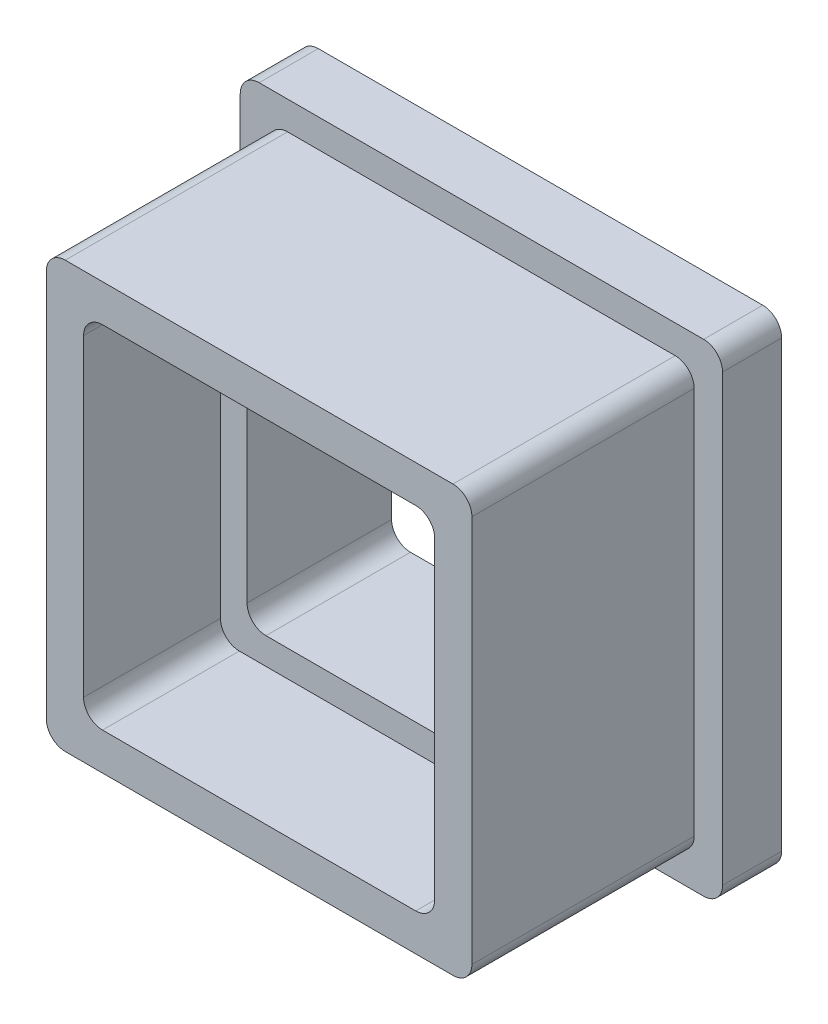
ISO-10303-21;
HEADER;
FILE_DESCRIPTION(('STEP AP214'),'2;1');
FILE_NAME('part.step','',(''),(''),'','','');
FILE_SCHEMA(('AUTOMOTIVE_DESIGN { 1 0 10303 214 1 1 1 1 }'));
ENDSEC;
DATA;
#1=APPLICATION_CONTEXT('core data for automotive mechanical design processes');
#2=APPLICATION_PROTOCOL_DEFINITION('international standard','automotive_design',2000,#1);
#3=PRODUCT_CONTEXT('',#1,'mechanical');
#4=PRODUCT('Part','Part','',(#3));
#5=PRODUCT_RELATED_PRODUCT_CATEGORY('part','',(#4));
#6=PRODUCT_DEFINITION_FORMATION('','',#4);
#7=PRODUCT_DEFINITION_CONTEXT('part definition',#1,'design');
#8=PRODUCT_DEFINITION('design','',#6,#7);
#9=PRODUCT_DEFINITION_SHAPE('','',#8);
#10=(LENGTH_UNIT() NAMED_UNIT(*) SI_UNIT(.MILLI.,.METRE.));
#11=(NAMED_UNIT(*) PLANE_ANGLE_UNIT() SI_UNIT($,.RADIAN.));
#12=(NAMED_UNIT(*) SI_UNIT($,.STERADIAN.) SOLID_ANGLE_UNIT());
#13=UNCERTAINTY_MEASURE_WITH_UNIT(LENGTH_MEASURE(1.E-05),#10,'distance_accuracy_value','');
#14=(GEOMETRIC_REPRESENTATION_CONTEXT(3) GLOBAL_UNCERTAINTY_ASSIGNED_CONTEXT((#13)) GLOBAL_UNIT_ASSIGNED_CONTEXT((#10,
#11,#12)) REPRESENTATION_CONTEXT('',''));
#15=CARTESIAN_POINT('',(0.,0.,0.));
#16=DIRECTION('',(0.,0.,1.));
#17=DIRECTION('',(1.,0.,0.));
#18=AXIS2_PLACEMENT_3D('',#15,#16,#17);
#19=CARTESIAN_POINT('',(5.715,5.715,-1.5875));
#20=DIRECTION('',(1.,0.,0.));
#21=DIRECTION('',(0.,1.,0.));
#22=AXIS2_PLACEMENT_3D('',#19,#20,#21);
#23=PLANE('',#22);
#24=DIRECTION('',(0.,0.,1.));
#25=VECTOR('',#24,1.);
#26=CARTESIAN_POINT('',(5.715,5.207,-1.5875));
#27=LINE('',#26,#25);
#28=CARTESIAN_POINT('',(5.715,5.207,-1.5875));
#29=VERTEX_POINT('',#28);
#30=CARTESIAN_POINT('',(5.715,5.207,4.3825));
#31=VERTEX_POINT('',#30);
#32=EDGE_CURVE('E273',#29,#31,#27,.T.);
#33=ORIENTED_EDGE('',*,*,#32,.T.);
#34=DIRECTION('',(0.,1.,0.));
#35=VECTOR('',#34,1.);
#36=CARTESIAN_POINT('',(5.71500000000001,-5.207,4.3825));
#37=LINE('',#36,#35);
#38=CARTESIAN_POINT('',(5.71500000000001,-5.207,4.3825));
#39=VERTEX_POINT('',#38);
#40=EDGE_CURVE('E333',#39,#31,#37,.T.);
#41=ORIENTED_EDGE('',*,*,#40,.F.);
#42=DIRECTION('',(0.,0.,1.));
#43=VECTOR('',#42,1.);
#44=CARTESIAN_POINT('',(5.71500000000001,-5.207,-1.5875));
#45=LINE('',#44,#43);
#46=CARTESIAN_POINT('',(5.71500000000001,-5.207,-1.5875));
#47=VERTEX_POINT('',#46);
#48=EDGE_CURVE('E276',#39,#47,#45,.F.);
#49=ORIENTED_EDGE('',*,*,#48,.T.);
#50=DIRECTION('',(0.,1.,0.));
#51=VECTOR('',#50,1.);
#52=CARTESIAN_POINT('',(5.715,5.715,-1.5875));
#53=LINE('',#52,#51);
#54=EDGE_CURVE('E318',#47,#29,#53,.T.);
#55=ORIENTED_EDGE('',*,*,#54,.T.);
#56=EDGE_LOOP('',(#33,#41,#49,#55));
#57=FACE_BOUND('',#56,.T.);
#58=ADVANCED_FACE('F35',(#57),#23,.T.);
#59=CARTESIAN_POINT('',(-5.715,-5.715,-1.5875));
#60=DIRECTION('',(0.,-1.,0.));
#61=DIRECTION('',(0.,0.,-1.));
#62=AXIS2_PLACEMENT_3D('',#59,#60,#61);
#63=PLANE('',#62);
#64=DIRECTION('',(0.,0.,1.));
#65=VECTOR('',#64,1.);
#66=CARTESIAN_POINT('',(5.20700000000001,-5.715,-1.5875));
#67=LINE('',#66,#65);
#68=CARTESIAN_POINT('',(5.207,-5.715,-1.5875));
#69=VERTEX_POINT('',#68);
#70=CARTESIAN_POINT('',(5.207,-5.715,4.3825));
#71=VERTEX_POINT('',#70);
#72=EDGE_CURVE('E263',#69,#71,#67,.T.);
#73=ORIENTED_EDGE('',*,*,#72,.T.);
#74=DIRECTION('',(1.,0.,0.));
#75=VECTOR('',#74,1.);
#76=CARTESIAN_POINT('',(-5.207,-5.715,4.3825));
#77=LINE('',#76,#75);
#78=CARTESIAN_POINT('',(-5.207,-5.715,4.3825));
#79=VERTEX_POINT('',#78);
#80=EDGE_CURVE('E885',#79,#71,#77,.T.);
#81=ORIENTED_EDGE('',*,*,#80,.F.);
#82=DIRECTION('',(0.,0.,1.));
#83=VECTOR('',#82,1.);
#84=CARTESIAN_POINT('',(-5.207,-5.715,-1.5875));
#85=LINE('',#84,#83);
#86=CARTESIAN_POINT('',(-5.207,-5.715,-1.5875));
#87=VERTEX_POINT('',#86);
#88=EDGE_CURVE('E271',#79,#87,#85,.F.);
#89=ORIENTED_EDGE('',*,*,#88,.T.);
#90=DIRECTION('',(1.,0.,0.));
#91=VECTOR('',#90,1.);
#92=CARTESIAN_POINT('',(-5.715,-5.715,-1.5875));
#93=LINE('',#92,#91);
#94=EDGE_CURVE('E405',#87,#69,#93,.T.);
#95=ORIENTED_EDGE('',*,*,#94,.T.);
#96=EDGE_LOOP('',(#73,#81,#89,#95));
#97=FACE_BOUND('',#96,.T.);
#98=ADVANCED_FACE('F541',(#97),#63,.T.);
#99=CARTESIAN_POINT('',(-5.71500000000001,5.715,-1.5875));
#100=DIRECTION('',(-1.,0.,0.));
#101=DIRECTION('',(0.,-1.,0.));
#102=AXIS2_PLACEMENT_3D('',#99,#100,#101);
#103=PLANE('',#102);
#104=DIRECTION('',(0.,0.,1.));
#105=VECTOR('',#104,1.);
#106=CARTESIAN_POINT('',(-5.715,-5.207,-1.5875));
#107=LINE('',#106,#105);
#108=CARTESIAN_POINT('',(-5.715,-5.207,-1.5875));
#109=VERTEX_POINT('',#108);
#110=CARTESIAN_POINT('',(-5.715,-5.207,4.3825));
#111=VERTEX_POINT('',#110);
#112=EDGE_CURVE('E257',#109,#111,#107,.T.);
#113=ORIENTED_EDGE('',*,*,#112,.T.);
#114=DIRECTION('',(0.,-1.,0.));
#115=VECTOR('',#114,1.);
#116=CARTESIAN_POINT('',(-5.71500000000001,5.207,4.3825));
#117=LINE('',#116,#115);
#118=CARTESIAN_POINT('',(-5.71500000000001,5.207,4.3825));
#119=VERTEX_POINT('',#118);
#120=EDGE_CURVE('E243',#119,#111,#117,.T.);
#121=ORIENTED_EDGE('',*,*,#120,.F.);
#122=DIRECTION('',(0.,0.,1.));
#123=VECTOR('',#122,1.);
#124=CARTESIAN_POINT('',(-5.71500000000001,5.207,-1.5875));
#125=LINE('',#124,#123);
#126=CARTESIAN_POINT('',(-5.71500000000001,5.207,-1.5875));
#127=VERTEX_POINT('',#126);
#128=EDGE_CURVE('E254',#119,#127,#125,.F.);
#129=ORIENTED_EDGE('',*,*,#128,.T.);
#130=DIRECTION('',(0.,-1.,0.));
#131=VECTOR('',#130,1.);
#132=CARTESIAN_POINT('',(-5.71500000000001,5.715,-1.5875));
#133=LINE('',#132,#131);
#134=EDGE_CURVE('E403',#127,#109,#133,.T.);
#135=ORIENTED_EDGE('',*,*,#134,.T.);
#136=EDGE_LOOP('',(#113,#121,#129,#135));
#137=FACE_BOUND('',#136,.T.);
#138=ADVANCED_FACE('F252',(#137),#103,.T.);
#139=CARTESIAN_POINT('',(-5.71500000000001,5.715,-1.5875));
#140=DIRECTION('',(0.,1.,0.));
#141=DIRECTION('',(0.,0.,1.));
#142=AXIS2_PLACEMENT_3D('',#139,#140,#141);
#143=PLANE('',#142);
#144=DIRECTION('',(0.,0.,1.));
#145=VECTOR('',#144,1.);
#146=CARTESIAN_POINT('',(-5.20700000000001,5.715,-1.5875));
#147=LINE('',#146,#145);
#148=CARTESIAN_POINT('',(-5.20700000000001,5.715,-1.5875));
#149=VERTEX_POINT('',#148);
#150=CARTESIAN_POINT('',(-5.20700000000001,5.715,4.3825));
#151=VERTEX_POINT('',#150);
#152=EDGE_CURVE('E283',#149,#151,#147,.T.);
#153=ORIENTED_EDGE('',*,*,#152,.T.);
#154=DIRECTION('',(-1.,0.,0.));
#155=VECTOR('',#154,1.);
#156=CARTESIAN_POINT('',(5.20699999999999,5.715,4.3825));
#157=LINE('',#156,#155);
#158=CARTESIAN_POINT('',(5.20699999999999,5.715,4.3825));
#159=VERTEX_POINT('',#158);
#160=EDGE_CURVE('E58',#159,#151,#157,.T.);
#161=ORIENTED_EDGE('',*,*,#160,.F.);
#162=DIRECTION('',(0.,0.,1.));
#163=VECTOR('',#162,1.);
#164=CARTESIAN_POINT('',(5.207,5.715,-1.5875));
#165=LINE('',#164,#163);
#166=CARTESIAN_POINT('',(5.20699999999999,5.715,-1.5875));
#167=VERTEX_POINT('',#166);
#168=EDGE_CURVE('E285',#159,#167,#165,.F.);
#169=ORIENTED_EDGE('',*,*,#168,.T.);
#170=DIRECTION('',(-1.,0.,0.));
#171=VECTOR('',#170,1.);
#172=CARTESIAN_POINT('',(-5.71500000000001,5.715,-1.5875));
#173=LINE('',#172,#171);
#174=EDGE_CURVE('E321',#167,#149,#173,.T.);
#175=ORIENTED_EDGE('',*,*,#174,.T.);
#176=EDGE_LOOP('',(#153,#161,#169,#175));
#177=FACE_BOUND('',#176,.T.);
#178=ADVANCED_FACE('F550',(#177),#143,.T.);
#179=CARTESIAN_POINT('',(4.715,4.715,0.7065));
#180=DIRECTION('',(1.,0.,0.));
#181=DIRECTION('',(0.,0.,-1.));
#182=AXIS2_PLACEMENT_3D('',#179,#180,#181);
#183=PLANE('',#182);
#184=DIRECTION('',(0.,-1.,0.));
#185=VECTOR('',#184,1.);
#186=CARTESIAN_POINT('',(4.715,4.715,4.3825));
#187=LINE('',#186,#185);
#188=CARTESIAN_POINT('',(4.715,4.207,4.3825));
#189=VERTEX_POINT('',#188);
#190=CARTESIAN_POINT('',(4.715,-4.207,4.3825));
#191=VERTEX_POINT('',#190);
#192=EDGE_CURVE('E50',#189,#191,#187,.T.);
#193=ORIENTED_EDGE('',*,*,#192,.F.);
#194=DIRECTION('',(0.,0.,1.));
#195=VECTOR('',#194,1.);
#196=CARTESIAN_POINT('',(4.715,4.207,0.7065));
#197=LINE('',#196,#195);
#198=CARTESIAN_POINT('',(4.715,4.207,0.7065));
#199=VERTEX_POINT('',#198);
#200=EDGE_CURVE('E446',#189,#199,#197,.F.);
#201=ORIENTED_EDGE('',*,*,#200,.T.);
#202=DIRECTION('',(0.,1.,0.));
#203=VECTOR('',#202,1.);
#204=CARTESIAN_POINT('',(4.715,4.715,0.7065));
#205=LINE('',#204,#203);
#206=CARTESIAN_POINT('',(4.715,-4.207,0.7065));
#207=VERTEX_POINT('',#206);
#208=EDGE_CURVE('E367',#207,#199,#205,.T.);
#209=ORIENTED_EDGE('',*,*,#208,.F.);
#210=DIRECTION('',(0.,0.,1.));
#211=VECTOR('',#210,1.);
#212=CARTESIAN_POINT('',(4.715,-4.207,4.7625));
#213=LINE('',#212,#211);
#214=EDGE_CURVE('E443',#207,#191,#213,.T.);
#215=ORIENTED_EDGE('',*,*,#214,.T.);
#216=EDGE_LOOP('',(#193,#201,#209,#215));
#217=FACE_BOUND('',#216,.T.);
#218=ADVANCED_FACE('F591',(#217),#183,.F.);
#219=CARTESIAN_POINT('',(-4.715,-4.715,0.7065));
#220=DIRECTION('',(0.,-1.,0.));
#221=DIRECTION('',(0.,0.,-1.));
#222=AXIS2_PLACEMENT_3D('',#219,#220,#221);
#223=PLANE('',#222);
#224=DIRECTION('',(-1.,0.,0.));
#225=VECTOR('',#224,1.);
#226=CARTESIAN_POINT('',(-4.715,-4.715,4.3825));
#227=LINE('',#226,#225);
#228=CARTESIAN_POINT('',(4.207,-4.715,4.3825));
#229=VERTEX_POINT('',#228);
#230=CARTESIAN_POINT('',(-4.207,-4.715,4.3825));
#231=VERTEX_POINT('',#230);
#232=EDGE_CURVE('E342',#229,#231,#227,.T.);
#233=ORIENTED_EDGE('',*,*,#232,.F.);
#234=DIRECTION('',(0.,0.,1.));
#235=VECTOR('',#234,1.);
#236=CARTESIAN_POINT('',(4.207,-4.715,0.7065));
#237=LINE('',#236,#235);
#238=CARTESIAN_POINT('',(4.207,-4.715,0.7065));
#239=VERTEX_POINT('',#238);
#240=EDGE_CURVE('E420',#229,#239,#237,.F.);
#241=ORIENTED_EDGE('',*,*,#240,.T.);
#242=DIRECTION('',(1.,0.,0.));
#243=VECTOR('',#242,1.);
#244=CARTESIAN_POINT('',(-4.715,-4.715,0.7065));
#245=LINE('',#244,#243);
#246=CARTESIAN_POINT('',(-4.207,-4.715,0.7065));
#247=VERTEX_POINT('',#246);
#248=EDGE_CURVE('E376',#247,#239,#245,.T.);
#249=ORIENTED_EDGE('',*,*,#248,.F.);
#250=DIRECTION('',(0.,0.,1.));
#251=VECTOR('',#250,1.);
#252=CARTESIAN_POINT('',(-4.207,-4.715,4.7625));
#253=LINE('',#252,#251);
#254=EDGE_CURVE('E422',#247,#231,#253,.T.);
#255=ORIENTED_EDGE('',*,*,#254,.T.);
#256=EDGE_LOOP('',(#233,#241,#249,#255));
#257=FACE_BOUND('',#256,.T.);
#258=ADVANCED_FACE('F615',(#257),#223,.F.);
#259=CARTESIAN_POINT('',(-4.715,4.715,0.7065));
#260=DIRECTION('',(-1.,0.,0.));
#261=DIRECTION('',(0.,0.,1.));
#262=AXIS2_PLACEMENT_3D('',#259,#260,#261);
#263=PLANE('',#262);
#264=DIRECTION('',(0.,1.,0.));
#265=VECTOR('',#264,1.);
#266=CARTESIAN_POINT('',(-4.715,4.715,4.3825));
#267=LINE('',#266,#265);
#268=CARTESIAN_POINT('',(-4.715,-4.207,4.3825));
#269=VERTEX_POINT('',#268);
#270=CARTESIAN_POINT('',(-4.715,4.207,4.3825));
#271=VERTEX_POINT('',#270);
#272=EDGE_CURVE('E351',#269,#271,#267,.T.);
#273=ORIENTED_EDGE('',*,*,#272,.F.);
#274=DIRECTION('',(0.,0.,1.));
#275=VECTOR('',#274,1.);
#276=CARTESIAN_POINT('',(-4.715,-4.207,0.7065));
#277=LINE('',#276,#275);
#278=CARTESIAN_POINT('',(-4.715,-4.207,0.7065));
#279=VERTEX_POINT('',#278);
#280=EDGE_CURVE('E428',#269,#279,#277,.F.);
#281=ORIENTED_EDGE('',*,*,#280,.T.);
#282=DIRECTION('',(0.,-1.,0.));
#283=VECTOR('',#282,1.);
#284=CARTESIAN_POINT('',(-4.715,4.715,0.7065));
#285=LINE('',#284,#283);
#286=CARTESIAN_POINT('',(-4.715,4.207,0.7065));
#287=VERTEX_POINT('',#286);
#288=EDGE_CURVE('E373',#287,#279,#285,.T.);
#289=ORIENTED_EDGE('',*,*,#288,.F.);
#290=DIRECTION('',(0.,0.,1.));
#291=VECTOR('',#290,1.);
#292=CARTESIAN_POINT('',(-4.715,4.207,4.7625));
#293=LINE('',#292,#291);
#294=EDGE_CURVE('E425',#287,#271,#293,.T.);
#295=ORIENTED_EDGE('',*,*,#294,.T.);
#296=EDGE_LOOP('',(#273,#281,#289,#295));
#297=FACE_BOUND('',#296,.T.);
#298=ADVANCED_FACE('F608',(#297),#263,.F.);
#299=CARTESIAN_POINT('',(-4.715,4.715,0.7065));
#300=DIRECTION('',(0.,1.,0.));
#301=DIRECTION('',(0.,0.,1.));
#302=AXIS2_PLACEMENT_3D('',#299,#300,#301);
#303=PLANE('',#302);
#304=DIRECTION('',(1.,0.,0.));
#305=VECTOR('',#304,1.);
#306=CARTESIAN_POINT('',(-4.715,4.715,4.3825));
#307=LINE('',#306,#305);
#308=CARTESIAN_POINT('',(-4.207,4.715,4.3825));
#309=VERTEX_POINT('',#308);
#310=CARTESIAN_POINT('',(4.207,4.715,4.3825));
#311=VERTEX_POINT('',#310);
#312=EDGE_CURVE('E349',#309,#311,#307,.T.);
#313=ORIENTED_EDGE('',*,*,#312,.F.);
#314=DIRECTION('',(0.,0.,1.));
#315=VECTOR('',#314,1.);
#316=CARTESIAN_POINT('',(-4.207,4.715,0.7065));
#317=LINE('',#316,#315);
#318=CARTESIAN_POINT('',(-4.207,4.715,0.7065));
#319=VERTEX_POINT('',#318);
#320=EDGE_CURVE('E441',#309,#319,#317,.F.);
#321=ORIENTED_EDGE('',*,*,#320,.T.);
#322=DIRECTION('',(-1.,0.,0.));
#323=VECTOR('',#322,1.);
#324=CARTESIAN_POINT('',(-4.715,4.715,0.7065));
#325=LINE('',#324,#323);
#326=CARTESIAN_POINT('',(4.207,4.715,0.7065));
#327=VERTEX_POINT('',#326);
#328=EDGE_CURVE('E370',#327,#319,#325,.T.);
#329=ORIENTED_EDGE('',*,*,#328,.F.);
#330=DIRECTION('',(0.,0.,1.));
#331=VECTOR('',#330,1.);
#332=CARTESIAN_POINT('',(4.207,4.715,4.7625));
#333=LINE('',#332,#331);
#334=EDGE_CURVE('E438',#327,#311,#333,.T.);
#335=ORIENTED_EDGE('',*,*,#334,.T.);
#336=EDGE_LOOP('',(#313,#321,#329,#335));
#337=FACE_BOUND('',#336,.T.);
#338=ADVANCED_FACE('F556',(#337),#303,.F.);
#339=CARTESIAN_POINT('',(-4.207,-4.207,0.7065));
#340=DIRECTION('',(0.,0.,-1.));
#341=DIRECTION('',(-1.,0.,0.));
#342=AXIS2_PLACEMENT_3D('',#339,#340,#341);
#343=CYLINDRICAL_SURFACE('',#342,0.508);
#344=CARTESIAN_POINT('',(-4.207,-4.207,4.3825));
#345=DIRECTION('',(0.,0.,1.));
#346=DIRECTION('',(1.,0.,0.));
#347=AXIS2_PLACEMENT_3D('',#344,#345,#346);
#348=CIRCLE('',#347,0.508);
#349=EDGE_CURVE('E347',#231,#269,#348,.F.);
#350=ORIENTED_EDGE('',*,*,#349,.F.);
#351=ORIENTED_EDGE('',*,*,#254,.F.);
#352=CARTESIAN_POINT('',(-4.207,-4.207,0.7065));
#353=DIRECTION('',(0.,0.,1.));
#354=DIRECTION('',(1.,0.,0.));
#355=AXIS2_PLACEMENT_3D('',#352,#353,#354);
#356=CIRCLE('',#355,0.508);
#357=EDGE_CURVE('E436',#279,#247,#356,.T.);
#358=ORIENTED_EDGE('',*,*,#357,.F.);
#359=ORIENTED_EDGE('',*,*,#280,.F.);
#360=EDGE_LOOP('',(#350,#351,#358,#359));
#361=FACE_BOUND('',#360,.T.);
#362=ADVANCED_FACE('F552',(#361),#343,.F.);
#363=CARTESIAN_POINT('',(-4.207,4.207,0.7065));
#364=DIRECTION('',(0.,0.,-1.));
#365=DIRECTION('',(-1.,0.,0.));
#366=AXIS2_PLACEMENT_3D('',#363,#364,#365);
#367=CYLINDRICAL_SURFACE('',#366,0.508);
#368=CARTESIAN_POINT('',(-4.207,4.207,4.3825));
#369=DIRECTION('',(0.,0.,1.));
#370=DIRECTION('',(1.,0.,0.));
#371=AXIS2_PLACEMENT_3D('',#368,#369,#370);
#372=CIRCLE('',#371,0.508);
#373=EDGE_CURVE('E353',#271,#309,#372,.F.);
#374=ORIENTED_EDGE('',*,*,#373,.F.);
#375=ORIENTED_EDGE('',*,*,#294,.F.);
#376=CARTESIAN_POINT('',(-4.207,4.207,0.7065));
#377=DIRECTION('',(0.,0.,1.));
#378=DIRECTION('',(1.,0.,0.));
#379=AXIS2_PLACEMENT_3D('',#376,#377,#378);
#380=CIRCLE('',#379,0.508);
#381=EDGE_CURVE('E434',#319,#287,#380,.T.);
#382=ORIENTED_EDGE('',*,*,#381,.F.);
#383=ORIENTED_EDGE('',*,*,#320,.F.);
#384=EDGE_LOOP('',(#374,#375,#382,#383));
#385=FACE_BOUND('',#384,.T.);
#386=ADVANCED_FACE('F555',(#385),#367,.F.);
#387=CARTESIAN_POINT('',(4.207,4.207,0.7065));
#388=DIRECTION('',(0.,0.,-1.));
#389=DIRECTION('',(-1.,0.,0.));
#390=AXIS2_PLACEMENT_3D('',#387,#388,#389);
#391=CYLINDRICAL_SURFACE('',#390,0.508);
#392=CARTESIAN_POINT('',(4.207,4.207,4.3825));
#393=DIRECTION('',(0.,0.,1.));
#394=DIRECTION('',(1.,0.,0.));
#395=AXIS2_PLACEMENT_3D('',#392,#393,#394);
#396=CIRCLE('',#395,0.508);
#397=EDGE_CURVE('E345',#311,#189,#396,.F.);
#398=ORIENTED_EDGE('',*,*,#397,.F.);
#399=ORIENTED_EDGE('',*,*,#334,.F.);
#400=CARTESIAN_POINT('',(4.207,4.207,0.7065));
#401=DIRECTION('',(0.,0.,1.));
#402=DIRECTION('',(1.,0.,0.));
#403=AXIS2_PLACEMENT_3D('',#400,#401,#402);
#404=CIRCLE('',#403,0.508);
#405=EDGE_CURVE('E432',#199,#327,#404,.T.);
#406=ORIENTED_EDGE('',*,*,#405,.F.);
#407=ORIENTED_EDGE('',*,*,#200,.F.);
#408=EDGE_LOOP('',(#398,#399,#406,#407));
#409=FACE_BOUND('',#408,.T.);
#410=ADVANCED_FACE('F560',(#409),#391,.F.);
#411=CARTESIAN_POINT('',(4.207,-4.207,0.7065));
#412=DIRECTION('',(0.,0.,-1.));
#413=DIRECTION('',(-1.,0.,0.));
#414=AXIS2_PLACEMENT_3D('',#411,#412,#413);
#415=CYLINDRICAL_SURFACE('',#414,0.508);
#416=CARTESIAN_POINT('',(4.207,-4.207,4.3825));
#417=DIRECTION('',(0.,0.,1.));
#418=DIRECTION('',(1.,0.,0.));
#419=AXIS2_PLACEMENT_3D('',#416,#417,#418);
#420=CIRCLE('',#419,0.508);
#421=EDGE_CURVE('E335',#191,#229,#420,.F.);
#422=ORIENTED_EDGE('',*,*,#421,.F.);
#423=ORIENTED_EDGE('',*,*,#214,.F.);
#424=CARTESIAN_POINT('',(4.207,-4.207,0.7065));
#425=DIRECTION('',(0.,0.,1.));
#426=DIRECTION('',(1.,0.,0.));
#427=AXIS2_PLACEMENT_3D('',#424,#425,#426);
#428=CIRCLE('',#427,0.508);
#429=EDGE_CURVE('E430',#239,#207,#428,.T.);
#430=ORIENTED_EDGE('',*,*,#429,.F.);
#431=ORIENTED_EDGE('',*,*,#240,.F.);
#432=EDGE_LOOP('',(#422,#423,#430,#431));
#433=FACE_BOUND('',#432,.T.);
#434=ADVANCED_FACE('F564',(#433),#415,.F.);
#435=CARTESIAN_POINT('',(-5.207,-5.207,-1.5875));
#436=DIRECTION('',(0.,0.,1.));
#437=DIRECTION('',(1.,0.,0.));
#438=AXIS2_PLACEMENT_3D('',#435,#436,#437);
#439=CYLINDRICAL_SURFACE('',#438,0.508);
#440=ORIENTED_EDGE('',*,*,#88,.F.);
#441=CARTESIAN_POINT('',(-5.207,-5.207,4.3825));
#442=DIRECTION('',(0.,0.,1.));
#443=DIRECTION('',(1.,0.,0.));
#444=AXIS2_PLACEMENT_3D('',#441,#442,#443);
#445=CIRCLE('',#444,0.508);
#446=EDGE_CURVE('E258',#111,#79,#445,.T.);
#447=ORIENTED_EDGE('',*,*,#446,.F.);
#448=ORIENTED_EDGE('',*,*,#112,.F.);
#449=CARTESIAN_POINT('',(-5.207,-5.207,-1.5875));
#450=DIRECTION('',(0.,0.,-1.));
#451=DIRECTION('',(-1.,0.,0.));
#452=AXIS2_PLACEMENT_3D('',#449,#450,#451);
#453=CIRCLE('',#452,0.508);
#454=EDGE_CURVE('E308',#87,#109,#453,.T.);
#455=ORIENTED_EDGE('',*,*,#454,.F.);
#456=EDGE_LOOP('',(#440,#447,#448,#455));
#457=FACE_BOUND('',#456,.T.);
#458=ADVANCED_FACE('F578',(#457),#439,.T.);
#459=CARTESIAN_POINT('',(5.20700000000001,-5.207,-1.5875));
#460=DIRECTION('',(0.,0.,1.));
#461=DIRECTION('',(1.,0.,0.));
#462=AXIS2_PLACEMENT_3D('',#459,#460,#461);
#463=CYLINDRICAL_SURFACE('',#462,0.508);
#464=ORIENTED_EDGE('',*,*,#48,.F.);
#465=CARTESIAN_POINT('',(5.20700000000001,-5.207,4.3825));
#466=DIRECTION('',(0.,0.,1.));
#467=DIRECTION('',(1.,0.,0.));
#468=AXIS2_PLACEMENT_3D('',#465,#466,#467);
#469=CIRCLE('',#468,0.508);
#470=EDGE_CURVE('E337',#71,#39,#469,.T.);
#471=ORIENTED_EDGE('',*,*,#470,.F.);
#472=ORIENTED_EDGE('',*,*,#72,.F.);
#473=CARTESIAN_POINT('',(5.20700000000001,-5.207,-1.5875));
#474=DIRECTION('',(0.,0.,-1.));
#475=DIRECTION('',(-1.,0.,0.));
#476=AXIS2_PLACEMENT_3D('',#473,#474,#475);
#477=CIRCLE('',#476,0.508);
#478=EDGE_CURVE('E310',#47,#69,#477,.T.);
#479=ORIENTED_EDGE('',*,*,#478,.F.);
#480=EDGE_LOOP('',(#464,#471,#472,#479));
#481=FACE_BOUND('',#480,.T.);
#482=ADVANCED_FACE('F583',(#481),#463,.T.);
#483=CARTESIAN_POINT('',(5.207,5.207,-1.5875));
#484=DIRECTION('',(0.,0.,1.));
#485=DIRECTION('',(1.,0.,0.));
#486=AXIS2_PLACEMENT_3D('',#483,#484,#485);
#487=CYLINDRICAL_SURFACE('',#486,0.508);
#488=ORIENTED_EDGE('',*,*,#168,.F.);
#489=CARTESIAN_POINT('',(5.207,5.207,4.3825));
#490=DIRECTION('',(0.,0.,1.));
#491=DIRECTION('',(1.,0.,0.));
#492=AXIS2_PLACEMENT_3D('',#489,#490,#491);
#493=CIRCLE('',#492,0.508);
#494=EDGE_CURVE('E332',#31,#159,#493,.T.);
#495=ORIENTED_EDGE('',*,*,#494,.F.);
#496=ORIENTED_EDGE('',*,*,#32,.F.);
#497=CARTESIAN_POINT('',(5.207,5.207,-1.5875));
#498=DIRECTION('',(0.,0.,-1.));
#499=DIRECTION('',(-1.,0.,0.));
#500=AXIS2_PLACEMENT_3D('',#497,#498,#499);
#501=CIRCLE('',#500,0.508);
#502=EDGE_CURVE('E43',#167,#29,#501,.T.);
#503=ORIENTED_EDGE('',*,*,#502,.F.);
#504=EDGE_LOOP('',(#488,#495,#496,#503));
#505=FACE_BOUND('',#504,.T.);
#506=ADVANCED_FACE('F331',(#505),#487,.T.);
#507=CARTESIAN_POINT('',(-5.20700000000001,5.207,-1.5875));
#508=DIRECTION('',(0.,0.,1.));
#509=DIRECTION('',(1.,0.,0.));
#510=AXIS2_PLACEMENT_3D('',#507,#508,#509);
#511=CYLINDRICAL_SURFACE('',#510,0.508);
#512=ORIENTED_EDGE('',*,*,#128,.F.);
#513=CARTESIAN_POINT('',(-5.20700000000001,5.207,4.3825));
#514=DIRECTION('',(0.,0.,1.));
#515=DIRECTION('',(1.,0.,0.));
#516=AXIS2_PLACEMENT_3D('',#513,#514,#515);
#517=CIRCLE('',#516,0.508);
#518=EDGE_CURVE('E240',#151,#119,#517,.T.);
#519=ORIENTED_EDGE('',*,*,#518,.F.);
#520=ORIENTED_EDGE('',*,*,#152,.F.);
#521=CARTESIAN_POINT('',(-5.20700000000001,5.207,-1.5875));
#522=DIRECTION('',(0.,0.,-1.));
#523=DIRECTION('',(-1.,0.,0.));
#524=AXIS2_PLACEMENT_3D('',#521,#522,#523);
#525=CIRCLE('',#524,0.508);
#526=EDGE_CURVE('E11',#127,#149,#525,.T.);
#527=ORIENTED_EDGE('',*,*,#526,.F.);
#528=EDGE_LOOP('',(#512,#519,#520,#527));
#529=FACE_BOUND('',#528,.T.);
#530=ADVANCED_FACE('F37',(#529),#511,.T.);
#531=CARTESIAN_POINT('',(-6.477,6.477,-3.175));
#532=DIRECTION('',(0.,-1.,0.));
#533=DIRECTION('',(1.,0.,0.));
#534=AXIS2_PLACEMENT_3D('',#531,#532,#533);
#535=PLANE('',#534);
#536=DIRECTION('',(1.,0.,0.));
#537=VECTOR('',#536,1.);
#538=CARTESIAN_POINT('',(-6.477,6.477,-1.5875));
#539=LINE('',#538,#537);
#540=CARTESIAN_POINT('',(-5.969,6.477,-1.5875));
#541=VERTEX_POINT('',#540);
#542=CARTESIAN_POINT('',(5.969,6.477,-1.5875));
#543=VERTEX_POINT('',#542);
#544=EDGE_CURVE('E379',#541,#543,#539,.T.);
#545=ORIENTED_EDGE('',*,*,#544,.T.);
#546=DIRECTION('',(0.,0.,1.));
#547=VECTOR('',#546,1.);
#548=CARTESIAN_POINT('',(5.969,6.477,-3.175));
#549=LINE('',#548,#547);
#550=CARTESIAN_POINT('',(5.969,6.477,-3.175));
#551=VERTEX_POINT('',#550);
#552=EDGE_CURVE('E290',#543,#551,#549,.F.);
#553=ORIENTED_EDGE('',*,*,#552,.T.);
#554=DIRECTION('',(1.,0.,0.));
#555=VECTOR('',#554,1.);
#556=CARTESIAN_POINT('',(-6.477,6.477,-3.175));
#557=LINE('',#556,#555);
#558=CARTESIAN_POINT('',(-5.969,6.477,-3.175));
#559=VERTEX_POINT('',#558);
#560=EDGE_CURVE('E380',#559,#551,#557,.T.);
#561=ORIENTED_EDGE('',*,*,#560,.F.);
#562=DIRECTION('',(0.,0.,1.));
#563=VECTOR('',#562,1.);
#564=CARTESIAN_POINT('',(-5.969,6.477,-3.175));
#565=LINE('',#564,#563);
#566=EDGE_CURVE('E287',#559,#541,#565,.T.);
#567=ORIENTED_EDGE('',*,*,#566,.T.);
#568=EDGE_LOOP('',(#545,#553,#561,#567));
#569=FACE_BOUND('',#568,.T.);
#570=ADVANCED_FACE('F514',(#569),#535,.F.);
#571=CARTESIAN_POINT('',(6.477,6.477,-3.175));
#572=DIRECTION('',(-1.,0.,0.));
#573=DIRECTION('',(0.,-1.,0.));
#574=AXIS2_PLACEMENT_3D('',#571,#572,#573);
#575=PLANE('',#574);
#576=DIRECTION('',(0.,-1.,0.));
#577=VECTOR('',#576,1.);
#578=CARTESIAN_POINT('',(6.477,6.477,-1.5875));
#579=LINE('',#578,#577);
#580=CARTESIAN_POINT('',(6.477,5.969,-1.5875));
#581=VERTEX_POINT('',#580);
#582=CARTESIAN_POINT('',(6.477,-5.96899999999999,-1.5875));
#583=VERTEX_POINT('',#582);
#584=EDGE_CURVE('E394',#581,#583,#579,.T.);
#585=ORIENTED_EDGE('',*,*,#584,.T.);
#586=DIRECTION('',(0.,0.,1.));
#587=VECTOR('',#586,1.);
#588=CARTESIAN_POINT('',(6.477,-5.969,-3.175));
#589=LINE('',#588,#587);
#590=CARTESIAN_POINT('',(6.477,-5.96899999999999,-3.175));
#591=VERTEX_POINT('',#590);
#592=EDGE_CURVE('E281',#583,#591,#589,.F.);
#593=ORIENTED_EDGE('',*,*,#592,.T.);
#594=DIRECTION('',(0.,-1.,0.));
#595=VECTOR('',#594,1.);
#596=CARTESIAN_POINT('',(6.477,6.477,-3.175));
#597=LINE('',#596,#595);
#598=CARTESIAN_POINT('',(6.477,5.969,-3.175));
#599=VERTEX_POINT('',#598);
#600=EDGE_CURVE('E383',#599,#591,#597,.T.);
#601=ORIENTED_EDGE('',*,*,#600,.F.);
#602=DIRECTION('',(0.,0.,1.));
#603=VECTOR('',#602,1.);
#604=CARTESIAN_POINT('',(6.477,5.969,-3.175));
#605=LINE('',#604,#603);
#606=EDGE_CURVE('E278',#599,#581,#605,.T.);
#607=ORIENTED_EDGE('',*,*,#606,.T.);
#608=EDGE_LOOP('',(#585,#593,#601,#607));
#609=FACE_BOUND('',#608,.T.);
#610=ADVANCED_FACE('F506',(#609),#575,.F.);
#611=CARTESIAN_POINT('',(6.477,-6.477,-3.175));
#612=DIRECTION('',(0.,1.,0.));
#613=DIRECTION('',(-1.,0.,0.));
#614=AXIS2_PLACEMENT_3D('',#611,#612,#613);
#615=PLANE('',#614);
#616=DIRECTION('',(-1.,0.,0.));
#617=VECTOR('',#616,1.);
#618=CARTESIAN_POINT('',(6.477,-6.477,-1.5875));
#619=LINE('',#618,#617);
#620=CARTESIAN_POINT('',(5.969,-6.477,-1.5875));
#621=VERTEX_POINT('',#620);
#622=CARTESIAN_POINT('',(-5.96899999999999,-6.477,-1.5875));
#623=VERTEX_POINT('',#622);
#624=EDGE_CURVE('E397',#621,#623,#619,.T.);
#625=ORIENTED_EDGE('',*,*,#624,.T.);
#626=DIRECTION('',(0.,0.,1.));
#627=VECTOR('',#626,1.);
#628=CARTESIAN_POINT('',(-5.969,-6.477,-3.175));
#629=LINE('',#628,#627);
#630=CARTESIAN_POINT('',(-5.96899999999999,-6.477,-3.175));
#631=VERTEX_POINT('',#630);
#632=EDGE_CURVE('E484',#623,#631,#629,.F.);
#633=ORIENTED_EDGE('',*,*,#632,.T.);
#634=DIRECTION('',(-1.,0.,0.));
#635=VECTOR('',#634,1.);
#636=CARTESIAN_POINT('',(6.477,-6.477,-3.175));
#637=LINE('',#636,#635);
#638=CARTESIAN_POINT('',(5.969,-6.477,-3.175));
#639=VERTEX_POINT('',#638);
#640=EDGE_CURVE('E387',#639,#631,#637,.T.);
#641=ORIENTED_EDGE('',*,*,#640,.F.);
#642=DIRECTION('',(0.,0.,1.));
#643=VECTOR('',#642,1.);
#644=CARTESIAN_POINT('',(5.969,-6.477,-3.175));
#645=LINE('',#644,#643);
#646=EDGE_CURVE('E481',#639,#621,#645,.T.);
#647=ORIENTED_EDGE('',*,*,#646,.T.);
#648=EDGE_LOOP('',(#625,#633,#641,#647));
#649=FACE_BOUND('',#648,.T.);
#650=ADVANCED_FACE('F499',(#649),#615,.F.);
#651=CARTESIAN_POINT('',(-6.477,-6.477,-3.175));
#652=DIRECTION('',(1.,0.,0.));
#653=DIRECTION('',(0.,0.,-1.));
#654=AXIS2_PLACEMENT_3D('',#651,#652,#653);
#655=PLANE('',#654);
#656=DIRECTION('',(0.,1.,0.));
#657=VECTOR('',#656,1.);
#658=CARTESIAN_POINT('',(-6.477,-6.477,-3.175));
#659=LINE('',#658,#657);
#660=CARTESIAN_POINT('',(-6.477,-5.969,-3.175));
#661=VERTEX_POINT('',#660);
#662=CARTESIAN_POINT('',(-6.477,5.969,-3.175));
#663=VERTEX_POINT('',#662);
#664=EDGE_CURVE('E328',#661,#663,#659,.T.);
#665=ORIENTED_EDGE('',*,*,#664,.F.);
#666=DIRECTION('',(0.,0.,1.));
#667=VECTOR('',#666,1.);
#668=CARTESIAN_POINT('',(-6.477,-5.969,-3.175));
#669=LINE('',#668,#667);
#670=CARTESIAN_POINT('',(-6.477,-5.969,-1.5875));
#671=VERTEX_POINT('',#670);
#672=EDGE_CURVE('E470',#661,#671,#669,.T.);
#673=ORIENTED_EDGE('',*,*,#672,.T.);
#674=DIRECTION('',(0.,1.,0.));
#675=VECTOR('',#674,1.);
#676=CARTESIAN_POINT('',(-6.477,-6.477,-1.5875));
#677=LINE('',#676,#675);
#678=CARTESIAN_POINT('',(-6.477,5.969,-1.5875));
#679=VERTEX_POINT('',#678);
#680=EDGE_CURVE('E384',#671,#679,#677,.T.);
#681=ORIENTED_EDGE('',*,*,#680,.T.);
#682=DIRECTION('',(0.,0.,1.));
#683=VECTOR('',#682,1.);
#684=CARTESIAN_POINT('',(-6.477,5.969,-3.175));
#685=LINE('',#684,#683);
#686=EDGE_CURVE('E468',#679,#663,#685,.F.);
#687=ORIENTED_EDGE('',*,*,#686,.T.);
#688=EDGE_LOOP('',(#665,#673,#681,#687));
#689=FACE_BOUND('',#688,.T.);
#690=ADVANCED_FACE('F523',(#689),#655,.F.);
#691=CARTESIAN_POINT('',(0.,0.,-3.175));
#692=DIRECTION('',(0.,0.,-1.));
#693=DIRECTION('',(-1.,0.,0.));
#694=AXIS2_PLACEMENT_3D('',#691,#692,#693);
#695=PLANE('',#694);
#696=DIRECTION('',(0.,-1.,0.));
#697=VECTOR('',#696,1.);
#698=CARTESIAN_POINT('',(4.,4.,-3.175));
#699=LINE('',#698,#697);
#700=CARTESIAN_POINT('',(4.,3.492,-3.175));
#701=VERTEX_POINT('',#700);
#702=CARTESIAN_POINT('',(4.,-3.492,-3.175));
#703=VERTEX_POINT('',#702);
#704=EDGE_CURVE('E355',#701,#703,#699,.T.);
#705=ORIENTED_EDGE('',*,*,#704,.F.);
#706=CARTESIAN_POINT('',(3.492,3.492,-3.175));
#707=DIRECTION('',(0.,0.,-1.));
#708=DIRECTION('',(-1.,0.,0.));
#709=AXIS2_PLACEMENT_3D('',#706,#707,#708);
#710=CIRCLE('',#709,0.508);
#711=CARTESIAN_POINT('',(3.492,4.,-3.175));
#712=VERTEX_POINT('',#711);
#713=EDGE_CURVE('E292',#701,#712,#710,.F.);
#714=ORIENTED_EDGE('',*,*,#713,.T.);
#715=DIRECTION('',(1.,0.,0.));
#716=VECTOR('',#715,1.);
#717=CARTESIAN_POINT('',(-4.,4.,-3.175));
#718=LINE('',#717,#716);
#719=CARTESIAN_POINT('',(-3.492,4.,-3.175));
#720=VERTEX_POINT('',#719);
#721=EDGE_CURVE('E364',#720,#712,#718,.T.);
#722=ORIENTED_EDGE('',*,*,#721,.F.);
#723=CARTESIAN_POINT('',(-3.492,3.492,-3.175));
#724=DIRECTION('',(0.,0.,-1.));
#725=DIRECTION('',(-1.,0.,0.));
#726=AXIS2_PLACEMENT_3D('',#723,#724,#725);
#727=CIRCLE('',#726,0.508);
#728=CARTESIAN_POINT('',(-4.,3.492,-3.175));
#729=VERTEX_POINT('',#728);
#730=EDGE_CURVE('E296',#720,#729,#727,.F.);
#731=ORIENTED_EDGE('',*,*,#730,.T.);
#732=DIRECTION('',(0.,1.,0.));
#733=VECTOR('',#732,1.);
#734=CARTESIAN_POINT('',(-4.,4.,-3.175));
#735=LINE('',#734,#733);
#736=CARTESIAN_POINT('',(-4.,-3.492,-3.175));
#737=VERTEX_POINT('',#736);
#738=EDGE_CURVE('E361',#737,#729,#735,.T.);
#739=ORIENTED_EDGE('',*,*,#738,.F.);
#740=CARTESIAN_POINT('',(-3.492,-3.492,-3.175));
#741=DIRECTION('',(0.,0.,-1.));
#742=DIRECTION('',(-1.,0.,0.));
#743=AXIS2_PLACEMENT_3D('',#740,#741,#742);
#744=CIRCLE('',#743,0.508);
#745=CARTESIAN_POINT('',(-3.492,-4.,-3.175));
#746=VERTEX_POINT('',#745);
#747=EDGE_CURVE('E300',#737,#746,#744,.F.);
#748=ORIENTED_EDGE('',*,*,#747,.T.);
#749=DIRECTION('',(-1.,0.,0.));
#750=VECTOR('',#749,1.);
#751=CARTESIAN_POINT('',(-4.,-4.,-3.175));
#752=LINE('',#751,#750);
#753=CARTESIAN_POINT('',(3.492,-4.,-3.175));
#754=VERTEX_POINT('',#753);
#755=EDGE_CURVE('E358',#754,#746,#752,.T.);
#756=ORIENTED_EDGE('',*,*,#755,.F.);
#757=CARTESIAN_POINT('',(3.492,-3.492,-3.175));
#758=DIRECTION('',(0.,0.,-1.));
#759=DIRECTION('',(-1.,0.,0.));
#760=AXIS2_PLACEMENT_3D('',#757,#758,#759);
#761=CIRCLE('',#760,0.508);
#762=EDGE_CURVE('E304',#754,#703,#761,.F.);
#763=ORIENTED_EDGE('',*,*,#762,.T.);
#764=EDGE_LOOP('',(#705,#714,#722,#731,#739,#748,#756,#763));
#765=FACE_BOUND('',#764,.T.);
#766=ORIENTED_EDGE('',*,*,#640,.T.);
#767=CARTESIAN_POINT('',(-5.969,-5.969,-3.175));
#768=DIRECTION('',(0.,0.,-1.));
#769=DIRECTION('',(-1.,0.,0.));
#770=AXIS2_PLACEMENT_3D('',#767,#768,#769);
#771=CIRCLE('',#770,0.508);
#772=EDGE_CURVE('E261',#631,#661,#771,.T.);
#773=ORIENTED_EDGE('',*,*,#772,.T.);
#774=ORIENTED_EDGE('',*,*,#664,.T.);
#775=CARTESIAN_POINT('',(-5.969,5.969,-3.175));
#776=DIRECTION('',(0.,0.,-1.));
#777=DIRECTION('',(-1.,0.,0.));
#778=AXIS2_PLACEMENT_3D('',#775,#776,#777);
#779=CIRCLE('',#778,0.508);
#780=EDGE_CURVE('E486',#663,#559,#779,.T.);
#781=ORIENTED_EDGE('',*,*,#780,.T.);
#782=ORIENTED_EDGE('',*,*,#560,.T.);
#783=CARTESIAN_POINT('',(5.969,5.969,-3.175));
#784=DIRECTION('',(0.,0.,-1.));
#785=DIRECTION('',(-1.,0.,0.));
#786=AXIS2_PLACEMENT_3D('',#783,#784,#785);
#787=CIRCLE('',#786,0.508);
#788=EDGE_CURVE('E488',#551,#599,#787,.T.);
#789=ORIENTED_EDGE('',*,*,#788,.T.);
#790=ORIENTED_EDGE('',*,*,#600,.T.);
#791=CARTESIAN_POINT('',(5.969,-5.969,-3.175));
#792=DIRECTION('',(0.,0.,-1.));
#793=DIRECTION('',(-1.,0.,0.));
#794=AXIS2_PLACEMENT_3D('',#791,#792,#793);
#795=CIRCLE('',#794,0.508);
#796=EDGE_CURVE('E265',#591,#639,#795,.T.);
#797=ORIENTED_EDGE('',*,*,#796,.T.);
#798=EDGE_LOOP('',(#766,#773,#774,#781,#782,#789,#790,#797));
#799=FACE_BOUND('',#798,.T.);
#800=ADVANCED_FACE('F492',(#765,#799),#695,.T.);
#801=CARTESIAN_POINT('',(0.,0.,-1.5875));
#802=DIRECTION('',(0.,0.,-1.));
#803=DIRECTION('',(-1.,0.,0.));
#804=AXIS2_PLACEMENT_3D('',#801,#802,#803);
#805=PLANE('',#804);
#806=ORIENTED_EDGE('',*,*,#54,.F.);
#807=ORIENTED_EDGE('',*,*,#478,.T.);
#808=ORIENTED_EDGE('',*,*,#94,.F.);
#809=ORIENTED_EDGE('',*,*,#454,.T.);
#810=ORIENTED_EDGE('',*,*,#134,.F.);
#811=ORIENTED_EDGE('',*,*,#526,.T.);
#812=ORIENTED_EDGE('',*,*,#174,.F.);
#813=ORIENTED_EDGE('',*,*,#502,.T.);
#814=EDGE_LOOP('',(#806,#807,#808,#809,#810,#811,#812,#813));
#815=FACE_BOUND('',#814,.T.);
#816=ORIENTED_EDGE('',*,*,#680,.F.);
#817=CARTESIAN_POINT('',(-5.969,-5.969,-1.5875));
#818=DIRECTION('',(0.,0.,-1.));
#819=DIRECTION('',(-1.,0.,0.));
#820=AXIS2_PLACEMENT_3D('',#817,#818,#819);
#821=CIRCLE('',#820,0.508);
#822=EDGE_CURVE('E479',#671,#623,#821,.F.);
#823=ORIENTED_EDGE('',*,*,#822,.T.);
#824=ORIENTED_EDGE('',*,*,#624,.F.);
#825=CARTESIAN_POINT('',(5.969,-5.969,-1.5875));
#826=DIRECTION('',(0.,0.,-1.));
#827=DIRECTION('',(-1.,0.,0.));
#828=AXIS2_PLACEMENT_3D('',#825,#826,#827);
#829=CIRCLE('',#828,0.508);
#830=EDGE_CURVE('E477',#621,#583,#829,.F.);
#831=ORIENTED_EDGE('',*,*,#830,.T.);
#832=ORIENTED_EDGE('',*,*,#584,.F.);
#833=CARTESIAN_POINT('',(5.969,5.969,-1.5875));
#834=DIRECTION('',(0.,0.,-1.));
#835=DIRECTION('',(-1.,0.,0.));
#836=AXIS2_PLACEMENT_3D('',#833,#834,#835);
#837=CIRCLE('',#836,0.508);
#838=EDGE_CURVE('E475',#581,#543,#837,.F.);
#839=ORIENTED_EDGE('',*,*,#838,.T.);
#840=ORIENTED_EDGE('',*,*,#544,.F.);
#841=CARTESIAN_POINT('',(-5.969,5.969,-1.5875));
#842=DIRECTION('',(0.,0.,-1.));
#843=DIRECTION('',(-1.,0.,0.));
#844=AXIS2_PLACEMENT_3D('',#841,#842,#843);
#845=CIRCLE('',#844,0.508);
#846=EDGE_CURVE('E473',#541,#679,#845,.F.);
#847=ORIENTED_EDGE('',*,*,#846,.T.);
#848=EDGE_LOOP('',(#816,#823,#824,#831,#832,#839,#840,#847));
#849=FACE_BOUND('',#848,.T.);
#850=ADVANCED_FACE('F316',(#815,#849),#805,.F.);
#851=CARTESIAN_POINT('',(0.,0.,0.7065));
#852=DIRECTION('',(0.,0.,1.));
#853=DIRECTION('',(1.,0.,0.));
#854=AXIS2_PLACEMENT_3D('',#851,#852,#853);
#855=PLANE('',#854);
#856=DIRECTION('',(0.,1.,0.));
#857=VECTOR('',#856,1.);
#858=CARTESIAN_POINT('',(4.,0.,0.7065));
#859=LINE('',#858,#857);
#860=CARTESIAN_POINT('',(4.,-3.492,0.7065));
#861=VERTEX_POINT('',#860);
#862=CARTESIAN_POINT('',(4.,3.492,0.7065));
#863=VERTEX_POINT('',#862);
#864=EDGE_CURVE('E417',#861,#863,#859,.T.);
#865=ORIENTED_EDGE('',*,*,#864,.F.);
#866=CARTESIAN_POINT('',(3.492,-3.492,0.7065));
#867=DIRECTION('',(0.,0.,1.));
#868=DIRECTION('',(1.,0.,0.));
#869=AXIS2_PLACEMENT_3D('',#866,#867,#868);
#870=CIRCLE('',#869,0.508);
#871=CARTESIAN_POINT('',(3.492,-4.,0.7065));
#872=VERTEX_POINT('',#871);
#873=EDGE_CURVE('E306',#861,#872,#870,.F.);
#874=ORIENTED_EDGE('',*,*,#873,.T.);
#875=DIRECTION('',(1.,0.,0.));
#876=VECTOR('',#875,1.);
#877=CARTESIAN_POINT('',(0.,-4.,0.7065));
#878=LINE('',#877,#876);
#879=CARTESIAN_POINT('',(-3.492,-4.,0.7065));
#880=VERTEX_POINT('',#879);
#881=EDGE_CURVE('E408',#880,#872,#878,.T.);
#882=ORIENTED_EDGE('',*,*,#881,.F.);
#883=CARTESIAN_POINT('',(-3.492,-3.492,0.7065));
#884=DIRECTION('',(0.,0.,1.));
#885=DIRECTION('',(1.,0.,0.));
#886=AXIS2_PLACEMENT_3D('',#883,#884,#885);
#887=CIRCLE('',#886,0.508);
#888=CARTESIAN_POINT('',(-4.,-3.492,0.7065));
#889=VERTEX_POINT('',#888);
#890=EDGE_CURVE('E302',#880,#889,#887,.F.);
#891=ORIENTED_EDGE('',*,*,#890,.T.);
#892=DIRECTION('',(0.,-1.,0.));
#893=VECTOR('',#892,1.);
#894=CARTESIAN_POINT('',(-4.,0.,0.7065));
#895=LINE('',#894,#893);
#896=CARTESIAN_POINT('',(-4.,3.492,0.7065));
#897=VERTEX_POINT('',#896);
#898=EDGE_CURVE('E411',#897,#889,#895,.T.);
#899=ORIENTED_EDGE('',*,*,#898,.F.);
#900=CARTESIAN_POINT('',(-3.492,3.492,0.7065));
#901=DIRECTION('',(0.,0.,1.));
#902=DIRECTION('',(1.,0.,0.));
#903=AXIS2_PLACEMENT_3D('',#900,#901,#902);
#904=CIRCLE('',#903,0.508);
#905=CARTESIAN_POINT('',(-3.492,4.,0.7065));
#906=VERTEX_POINT('',#905);
#907=EDGE_CURVE('E298',#897,#906,#904,.F.);
#908=ORIENTED_EDGE('',*,*,#907,.T.);
#909=DIRECTION('',(-1.,0.,0.));
#910=VECTOR('',#909,1.);
#911=CARTESIAN_POINT('',(0.,4.,0.7065));
#912=LINE('',#911,#910);
#913=CARTESIAN_POINT('',(3.492,4.,0.7065));
#914=VERTEX_POINT('',#913);
#915=EDGE_CURVE('E414',#914,#906,#912,.T.);
#916=ORIENTED_EDGE('',*,*,#915,.F.);
#917=CARTESIAN_POINT('',(3.492,3.492,0.7065));
#918=DIRECTION('',(0.,0.,1.));
#919=DIRECTION('',(1.,0.,0.));
#920=AXIS2_PLACEMENT_3D('',#917,#918,#919);
#921=CIRCLE('',#920,0.508);
#922=EDGE_CURVE('E294',#914,#863,#921,.F.);
#923=ORIENTED_EDGE('',*,*,#922,.T.);
#924=EDGE_LOOP('',(#865,#874,#882,#891,#899,#908,#916,#923));
#925=FACE_BOUND('',#924,.T.);
#926=ORIENTED_EDGE('',*,*,#288,.T.);
#927=ORIENTED_EDGE('',*,*,#357,.T.);
#928=ORIENTED_EDGE('',*,*,#248,.T.);
#929=ORIENTED_EDGE('',*,*,#429,.T.);
#930=ORIENTED_EDGE('',*,*,#208,.T.);
#931=ORIENTED_EDGE('',*,*,#405,.T.);
#932=ORIENTED_EDGE('',*,*,#328,.T.);
#933=ORIENTED_EDGE('',*,*,#381,.T.);
#934=EDGE_LOOP('',(#926,#927,#928,#929,#930,#931,#932,#933));
#935=FACE_BOUND('',#934,.T.);
#936=ADVANCED_FACE('F595',(#925,#935),#855,.T.);
#937=CARTESIAN_POINT('',(4.,4.,4.7625));
#938=DIRECTION('',(1.,0.,0.));
#939=DIRECTION('',(0.,1.,0.));
#940=AXIS2_PLACEMENT_3D('',#937,#938,#939);
#941=PLANE('',#940);
#942=ORIENTED_EDGE('',*,*,#864,.T.);
#943=DIRECTION('',(0.,0.,-1.));
#944=VECTOR('',#943,1.);
#945=CARTESIAN_POINT('',(4.,3.492,-3.175));
#946=LINE('',#945,#944);
#947=EDGE_CURVE('E450',#863,#701,#946,.T.);
#948=ORIENTED_EDGE('',*,*,#947,.T.);
#949=ORIENTED_EDGE('',*,*,#704,.T.);
#950=DIRECTION('',(0.,0.,-1.));
#951=VECTOR('',#950,1.);
#952=CARTESIAN_POINT('',(4.,-3.492,0.7065));
#953=LINE('',#952,#951);
#954=EDGE_CURVE('E448',#703,#861,#953,.F.);
#955=ORIENTED_EDGE('',*,*,#954,.T.);
#956=EDGE_LOOP('',(#942,#948,#949,#955));
#957=FACE_BOUND('',#956,.T.);
#958=ADVANCED_FACE('F626',(#957),#941,.F.);
#959=CARTESIAN_POINT('',(-4.,4.,4.7625));
#960=DIRECTION('',(0.,1.,0.));
#961=DIRECTION('',(-1.,0.,0.));
#962=AXIS2_PLACEMENT_3D('',#959,#960,#961);
#963=PLANE('',#962);
#964=ORIENTED_EDGE('',*,*,#721,.T.);
#965=DIRECTION('',(0.,0.,-1.));
#966=VECTOR('',#965,1.);
#967=CARTESIAN_POINT('',(3.492,4.,0.7065));
#968=LINE('',#967,#966);
#969=EDGE_CURVE('E456',#712,#914,#968,.F.);
#970=ORIENTED_EDGE('',*,*,#969,.T.);
#971=ORIENTED_EDGE('',*,*,#915,.T.);
#972=DIRECTION('',(0.,0.,-1.));
#973=VECTOR('',#972,1.);
#974=CARTESIAN_POINT('',(-3.492,4.,-3.175));
#975=LINE('',#974,#973);
#976=EDGE_CURVE('E453',#906,#720,#975,.T.);
#977=ORIENTED_EDGE('',*,*,#976,.T.);
#978=EDGE_LOOP('',(#964,#970,#971,#977));
#979=FACE_BOUND('',#978,.T.);
#980=ADVANCED_FACE('F622',(#979),#963,.F.);
#981=CARTESIAN_POINT('',(-4.,4.,4.7625));
#982=DIRECTION('',(-1.,0.,0.));
#983=DIRECTION('',(0.,-1.,0.));
#984=AXIS2_PLACEMENT_3D('',#981,#982,#983);
#985=PLANE('',#984);
#986=ORIENTED_EDGE('',*,*,#738,.T.);
#987=DIRECTION('',(0.,0.,-1.));
#988=VECTOR('',#987,1.);
#989=CARTESIAN_POINT('',(-4.,3.492,0.7065));
#990=LINE('',#989,#988);
#991=EDGE_CURVE('E461',#729,#897,#990,.F.);
#992=ORIENTED_EDGE('',*,*,#991,.T.);
#993=ORIENTED_EDGE('',*,*,#898,.T.);
#994=DIRECTION('',(0.,0.,-1.));
#995=VECTOR('',#994,1.);
#996=CARTESIAN_POINT('',(-4.,-3.492,-3.175));
#997=LINE('',#996,#995);
#998=EDGE_CURVE('E458',#889,#737,#997,.T.);
#999=ORIENTED_EDGE('',*,*,#998,.T.);
#1000=EDGE_LOOP('',(#986,#992,#993,#999));
#1001=FACE_BOUND('',#1000,.T.);
#1002=ADVANCED_FACE('F625',(#1001),#985,.F.);
#1003=CARTESIAN_POINT('',(-4.,-4.,4.7625));
#1004=DIRECTION('',(0.,-1.,0.));
#1005=DIRECTION('',(1.,0.,0.));
#1006=AXIS2_PLACEMENT_3D('',#1003,#1004,#1005);
#1007=PLANE('',#1006);
#1008=ORIENTED_EDGE('',*,*,#755,.T.);
#1009=DIRECTION('',(0.,0.,-1.));
#1010=VECTOR('',#1009,1.);
#1011=CARTESIAN_POINT('',(-3.492,-4.,0.7065));
#1012=LINE('',#1011,#1010);
#1013=EDGE_CURVE('E466',#746,#880,#1012,.F.);
#1014=ORIENTED_EDGE('',*,*,#1013,.T.);
#1015=ORIENTED_EDGE('',*,*,#881,.T.);
#1016=DIRECTION('',(0.,0.,-1.));
#1017=VECTOR('',#1016,1.);
#1018=CARTESIAN_POINT('',(3.492,-4.,-3.175));
#1019=LINE('',#1018,#1017);
#1020=EDGE_CURVE('E463',#872,#754,#1019,.T.);
#1021=ORIENTED_EDGE('',*,*,#1020,.T.);
#1022=EDGE_LOOP('',(#1008,#1014,#1015,#1021));
#1023=FACE_BOUND('',#1022,.T.);
#1024=ADVANCED_FACE('F570',(#1023),#1007,.F.);
#1025=CARTESIAN_POINT('',(3.492,3.492,4.7625));
#1026=DIRECTION('',(0.,0.,1.));
#1027=DIRECTION('',(1.,0.,0.));
#1028=AXIS2_PLACEMENT_3D('',#1025,#1026,#1027);
#1029=CYLINDRICAL_SURFACE('',#1028,0.508);
#1030=ORIENTED_EDGE('',*,*,#922,.F.);
#1031=ORIENTED_EDGE('',*,*,#969,.F.);
#1032=ORIENTED_EDGE('',*,*,#713,.F.);
#1033=ORIENTED_EDGE('',*,*,#947,.F.);
#1034=EDGE_LOOP('',(#1030,#1031,#1032,#1033));
#1035=FACE_BOUND('',#1034,.T.);
#1036=ADVANCED_FACE('F566',(#1035),#1029,.F.);
#1037=CARTESIAN_POINT('',(-3.492,3.492,4.7625));
#1038=DIRECTION('',(0.,0.,1.));
#1039=DIRECTION('',(1.,0.,0.));
#1040=AXIS2_PLACEMENT_3D('',#1037,#1038,#1039);
#1041=CYLINDRICAL_SURFACE('',#1040,0.508);
#1042=ORIENTED_EDGE('',*,*,#907,.F.);
#1043=ORIENTED_EDGE('',*,*,#991,.F.);
#1044=ORIENTED_EDGE('',*,*,#730,.F.);
#1045=ORIENTED_EDGE('',*,*,#976,.F.);
#1046=EDGE_LOOP('',(#1042,#1043,#1044,#1045));
#1047=FACE_BOUND('',#1046,.T.);
#1048=ADVANCED_FACE('F569',(#1047),#1041,.F.);
#1049=CARTESIAN_POINT('',(-3.492,-3.492,4.7625));
#1050=DIRECTION('',(0.,0.,1.));
#1051=DIRECTION('',(1.,0.,0.));
#1052=AXIS2_PLACEMENT_3D('',#1049,#1050,#1051);
#1053=CYLINDRICAL_SURFACE('',#1052,0.508);
#1054=ORIENTED_EDGE('',*,*,#890,.F.);
#1055=ORIENTED_EDGE('',*,*,#1013,.F.);
#1056=ORIENTED_EDGE('',*,*,#747,.F.);
#1057=ORIENTED_EDGE('',*,*,#998,.F.);
#1058=EDGE_LOOP('',(#1054,#1055,#1056,#1057));
#1059=FACE_BOUND('',#1058,.T.);
#1060=ADVANCED_FACE('F535',(#1059),#1053,.F.);
#1061=CARTESIAN_POINT('',(3.492,-3.492,4.7625));
#1062=DIRECTION('',(0.,0.,1.));
#1063=DIRECTION('',(1.,0.,0.));
#1064=AXIS2_PLACEMENT_3D('',#1061,#1062,#1063);
#1065=CYLINDRICAL_SURFACE('',#1064,0.508);
#1066=ORIENTED_EDGE('',*,*,#873,.F.);
#1067=ORIENTED_EDGE('',*,*,#954,.F.);
#1068=ORIENTED_EDGE('',*,*,#762,.F.);
#1069=ORIENTED_EDGE('',*,*,#1020,.F.);
#1070=EDGE_LOOP('',(#1066,#1067,#1068,#1069));
#1071=FACE_BOUND('',#1070,.T.);
#1072=ADVANCED_FACE('F528',(#1071),#1065,.F.);
#1073=CARTESIAN_POINT('',(-5.969,-5.969,-3.175));
#1074=DIRECTION('',(0.,0.,1.));
#1075=DIRECTION('',(1.,0.,0.));
#1076=AXIS2_PLACEMENT_3D('',#1073,#1074,#1075);
#1077=CYLINDRICAL_SURFACE('',#1076,0.508);
#1078=ORIENTED_EDGE('',*,*,#772,.F.);
#1079=ORIENTED_EDGE('',*,*,#632,.F.);
#1080=ORIENTED_EDGE('',*,*,#822,.F.);
#1081=ORIENTED_EDGE('',*,*,#672,.F.);
#1082=EDGE_LOOP('',(#1078,#1079,#1080,#1081));
#1083=FACE_BOUND('',#1082,.T.);
#1084=ADVANCED_FACE('F526',(#1083),#1077,.T.);
#1085=CARTESIAN_POINT('',(5.969,-5.969,-3.175));
#1086=DIRECTION('',(0.,0.,1.));
#1087=DIRECTION('',(1.,0.,0.));
#1088=AXIS2_PLACEMENT_3D('',#1085,#1086,#1087);
#1089=CYLINDRICAL_SURFACE('',#1088,0.508);
#1090=ORIENTED_EDGE('',*,*,#796,.F.);
#1091=ORIENTED_EDGE('',*,*,#592,.F.);
#1092=ORIENTED_EDGE('',*,*,#830,.F.);
#1093=ORIENTED_EDGE('',*,*,#646,.F.);
#1094=EDGE_LOOP('',(#1090,#1091,#1092,#1093));
#1095=FACE_BOUND('',#1094,.T.);
#1096=ADVANCED_FACE('F502',(#1095),#1089,.T.);
#1097=CARTESIAN_POINT('',(5.969,5.969,-3.175));
#1098=DIRECTION('',(0.,0.,1.));
#1099=DIRECTION('',(1.,0.,0.));
#1100=AXIS2_PLACEMENT_3D('',#1097,#1098,#1099);
#1101=CYLINDRICAL_SURFACE('',#1100,0.508);
#1102=ORIENTED_EDGE('',*,*,#788,.F.);
#1103=ORIENTED_EDGE('',*,*,#552,.F.);
#1104=ORIENTED_EDGE('',*,*,#838,.F.);
#1105=ORIENTED_EDGE('',*,*,#606,.F.);
#1106=EDGE_LOOP('',(#1102,#1103,#1104,#1105));
#1107=FACE_BOUND('',#1106,.T.);
#1108=ADVANCED_FACE('F510',(#1107),#1101,.T.);
#1109=CARTESIAN_POINT('',(-5.969,5.969,-3.175));
#1110=DIRECTION('',(0.,0.,1.));
#1111=DIRECTION('',(1.,0.,0.));
#1112=AXIS2_PLACEMENT_3D('',#1109,#1110,#1111);
#1113=CYLINDRICAL_SURFACE('',#1112,0.508);
#1114=ORIENTED_EDGE('',*,*,#780,.F.);
#1115=ORIENTED_EDGE('',*,*,#686,.F.);
#1116=ORIENTED_EDGE('',*,*,#846,.F.);
#1117=ORIENTED_EDGE('',*,*,#566,.F.);
#1118=EDGE_LOOP('',(#1114,#1115,#1116,#1117));
#1119=FACE_BOUND('',#1118,.T.);
#1120=ADVANCED_FACE('F519',(#1119),#1113,.T.);
#1121=CARTESIAN_POINT('',(-5.20700000000001,5.207,4.3825));
#1122=DIRECTION('',(0.,0.,1.));
#1123=DIRECTION('',(1.,0.,0.));
#1124=AXIS2_PLACEMENT_3D('',#1121,#1122,#1123);
#1125=PLANE('',#1124);
#1126=ORIENTED_EDGE('',*,*,#518,.T.);
#1127=ORIENTED_EDGE('',*,*,#120,.T.);
#1128=ORIENTED_EDGE('',*,*,#446,.T.);
#1129=ORIENTED_EDGE('',*,*,#80,.T.);
#1130=ORIENTED_EDGE('',*,*,#470,.T.);
#1131=ORIENTED_EDGE('',*,*,#40,.T.);
#1132=ORIENTED_EDGE('',*,*,#494,.T.);
#1133=ORIENTED_EDGE('',*,*,#160,.T.);
#1134=EDGE_LOOP('',(#1126,#1127,#1128,#1129,#1130,#1131,#1132,#1133));
#1135=FACE_BOUND('',#1134,.T.);
#1136=ORIENTED_EDGE('',*,*,#373,.T.);
#1137=ORIENTED_EDGE('',*,*,#312,.T.);
#1138=ORIENTED_EDGE('',*,*,#397,.T.);
#1139=ORIENTED_EDGE('',*,*,#192,.T.);
#1140=ORIENTED_EDGE('',*,*,#421,.T.);
#1141=ORIENTED_EDGE('',*,*,#232,.T.);
#1142=ORIENTED_EDGE('',*,*,#349,.T.);
#1143=ORIENTED_EDGE('',*,*,#272,.T.);
#1144=EDGE_LOOP('',(#1136,#1137,#1138,#1139,#1140,#1141,#1142,#1143));
#1145=FACE_BOUND('',#1144,.T.);
#1146=ADVANCED_FACE('F242',(#1135,#1145),#1125,.T.);
#1147=CLOSED_SHELL('',(#58,#98,#138,#178,#218,#258,#298,#338,#362,#386,#410,#434,#458,#482,#506,
#530,#570,#610,#650,#690,#800,#850,#936,#958,#980,#1002,#1024,#1036,#1048,#1060,#1072,#1084,
#1096,#1108,#1120,#1146));
#1148=MANIFOLD_SOLID_BREP('B2',#1147);
#1149=ADVANCED_BREP_SHAPE_REPRESENTATION('',(#18,#1148),#14);
#1150=SHAPE_DEFINITION_REPRESENTATION(#9,#1149);
ENDSEC;
END-ISO-10303-21;
